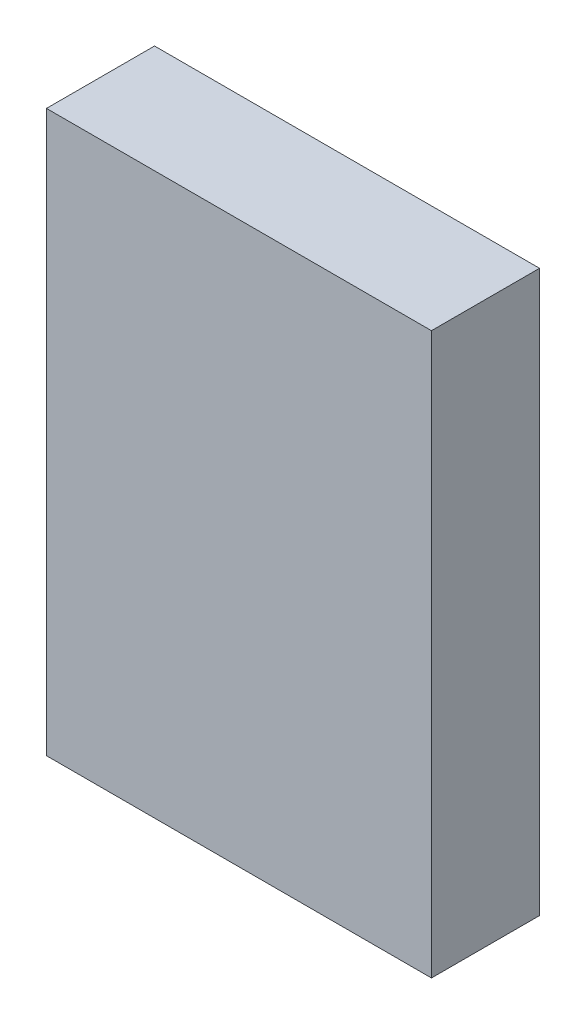
ISO-10303-21;
HEADER;
FILE_DESCRIPTION(('STEP AP214'),'2;1');
FILE_NAME('part.step','',(''),(''),'','','');
FILE_SCHEMA(('AUTOMOTIVE_DESIGN { 1 0 10303 214 1 1 1 1 }'));
ENDSEC;
DATA;
#1=APPLICATION_CONTEXT('core data for automotive mechanical design processes');
#2=APPLICATION_PROTOCOL_DEFINITION('international standard','automotive_design',2000,#1);
#3=PRODUCT_CONTEXT('',#1,'mechanical');
#4=PRODUCT('Part','Part','',(#3));
#5=PRODUCT_RELATED_PRODUCT_CATEGORY('part','',(#4));
#6=PRODUCT_DEFINITION_FORMATION('','',#4);
#7=PRODUCT_DEFINITION_CONTEXT('part definition',#1,'design');
#8=PRODUCT_DEFINITION('design','',#6,#7);
#9=PRODUCT_DEFINITION_SHAPE('','',#8);
#10=(LENGTH_UNIT() NAMED_UNIT(*) SI_UNIT(.MILLI.,.METRE.));
#11=(NAMED_UNIT(*) PLANE_ANGLE_UNIT() SI_UNIT($,.RADIAN.));
#12=(NAMED_UNIT(*) SI_UNIT($,.STERADIAN.) SOLID_ANGLE_UNIT());
#13=UNCERTAINTY_MEASURE_WITH_UNIT(LENGTH_MEASURE(1.E-05),#10,'distance_accuracy_value','');
#14=(GEOMETRIC_REPRESENTATION_CONTEXT(3) GLOBAL_UNCERTAINTY_ASSIGNED_CONTEXT((#13)) GLOBAL_UNIT_ASSIGNED_CONTEXT((#10,
#11,#12)) REPRESENTATION_CONTEXT('',''));
#15=CARTESIAN_POINT('',(0.,0.,0.));
#16=DIRECTION('',(0.,0.,1.));
#17=DIRECTION('',(1.,0.,0.));
#18=AXIS2_PLACEMENT_3D('',#15,#16,#17);
#19=CARTESIAN_POINT('',(0.,0.,16.));
#20=DIRECTION('',(0.,1.,0.));
#21=DIRECTION('',(0.,0.,1.));
#22=AXIS2_PLACEMENT_3D('',#19,#20,#21);
#23=PLANE('',#22);
#24=DIRECTION('',(1.,0.,0.));
#25=VECTOR('',#24,1.);
#26=CARTESIAN_POINT('',(0.,0.,0.));
#27=LINE('',#26,#25);
#28=CARTESIAN_POINT('',(-57.,0.,0.));
#29=VERTEX_POINT('',#28);
#30=CARTESIAN_POINT('',(0.,0.,0.));
#31=VERTEX_POINT('',#30);
#32=EDGE_CURVE('E106',#29,#31,#27,.T.);
#33=ORIENTED_EDGE('',*,*,#32,.T.);
#34=DIRECTION('',(0.,0.,-1.));
#35=VECTOR('',#34,1.);
#36=CARTESIAN_POINT('',(0.,0.,16.));
#37=LINE('',#36,#35);
#38=CARTESIAN_POINT('',(0.,0.,16.));
#39=VERTEX_POINT('',#38);
#40=EDGE_CURVE('E11',#39,#31,#37,.T.);
#41=ORIENTED_EDGE('',*,*,#40,.F.);
#42=DIRECTION('',(1.,0.,0.));
#43=VECTOR('',#42,1.);
#44=CARTESIAN_POINT('',(0.,0.,16.));
#45=LINE('',#44,#43);
#46=CARTESIAN_POINT('',(-57.,0.,16.));
#47=VERTEX_POINT('',#46);
#48=EDGE_CURVE('E94',#47,#39,#45,.T.);
#49=ORIENTED_EDGE('',*,*,#48,.F.);
#50=DIRECTION('',(0.,0.,-1.));
#51=VECTOR('',#50,1.);
#52=CARTESIAN_POINT('',(-57.,0.,16.));
#53=LINE('',#52,#51);
#54=EDGE_CURVE('E102',#47,#29,#53,.T.);
#55=ORIENTED_EDGE('',*,*,#54,.T.);
#56=EDGE_LOOP('',(#33,#41,#49,#55));
#57=FACE_BOUND('',#56,.T.);
#58=ADVANCED_FACE('F43',(#57),#23,.F.);
#59=CARTESIAN_POINT('',(0.,0.,16.));
#60=DIRECTION('',(-1.,0.,0.));
#61=DIRECTION('',(0.,0.,1.));
#62=AXIS2_PLACEMENT_3D('',#59,#60,#61);
#63=PLANE('',#62);
#64=DIRECTION('',(0.,1.,0.));
#65=VECTOR('',#64,1.);
#66=CARTESIAN_POINT('',(0.,0.,0.));
#67=LINE('',#66,#65);
#68=CARTESIAN_POINT('',(0.,83.,0.));
#69=VERTEX_POINT('',#68);
#70=EDGE_CURVE('E98',#31,#69,#67,.T.);
#71=ORIENTED_EDGE('',*,*,#70,.T.);
#72=DIRECTION('',(0.,0.,-1.));
#73=VECTOR('',#72,1.);
#74=CARTESIAN_POINT('',(0.,83.,16.));
#75=LINE('',#74,#73);
#76=CARTESIAN_POINT('',(0.,83.,16.));
#77=VERTEX_POINT('',#76);
#78=EDGE_CURVE('E51',#77,#69,#75,.T.);
#79=ORIENTED_EDGE('',*,*,#78,.F.);
#80=DIRECTION('',(0.,1.,0.));
#81=VECTOR('',#80,1.);
#82=CARTESIAN_POINT('',(0.,0.,16.));
#83=LINE('',#82,#81);
#84=EDGE_CURVE('E89',#39,#77,#83,.T.);
#85=ORIENTED_EDGE('',*,*,#84,.F.);
#86=ORIENTED_EDGE('',*,*,#40,.T.);
#87=EDGE_LOOP('',(#71,#79,#85,#86));
#88=FACE_BOUND('',#87,.T.);
#89=ADVANCED_FACE('F97',(#88),#63,.F.);
#90=CARTESIAN_POINT('',(0.,83.,16.));
#91=DIRECTION('',(0.,-1.,0.));
#92=DIRECTION('',(0.,0.,-1.));
#93=AXIS2_PLACEMENT_3D('',#90,#91,#92);
#94=PLANE('',#93);
#95=DIRECTION('',(-1.,0.,0.));
#96=VECTOR('',#95,1.);
#97=CARTESIAN_POINT('',(0.,83.,0.));
#98=LINE('',#97,#96);
#99=CARTESIAN_POINT('',(-57.,83.,0.));
#100=VERTEX_POINT('',#99);
#101=EDGE_CURVE('E76',#69,#100,#98,.T.);
#102=ORIENTED_EDGE('',*,*,#101,.T.);
#103=DIRECTION('',(0.,0.,-1.));
#104=VECTOR('',#103,1.);
#105=CARTESIAN_POINT('',(-57.,83.,16.));
#106=LINE('',#105,#104);
#107=CARTESIAN_POINT('',(-57.,83.,16.));
#108=VERTEX_POINT('',#107);
#109=EDGE_CURVE('E99',#108,#100,#106,.T.);
#110=ORIENTED_EDGE('',*,*,#109,.F.);
#111=DIRECTION('',(-1.,0.,0.));
#112=VECTOR('',#111,1.);
#113=CARTESIAN_POINT('',(0.,83.,16.));
#114=LINE('',#113,#112);
#115=EDGE_CURVE('E92',#77,#108,#114,.T.);
#116=ORIENTED_EDGE('',*,*,#115,.F.);
#117=ORIENTED_EDGE('',*,*,#78,.T.);
#118=EDGE_LOOP('',(#102,#110,#116,#117));
#119=FACE_BOUND('',#118,.T.);
#120=ADVANCED_FACE('F100',(#119),#94,.F.);
#121=CARTESIAN_POINT('',(-57.,0.,16.));
#122=DIRECTION('',(1.,0.,0.));
#123=DIRECTION('',(0.,0.,-1.));
#124=AXIS2_PLACEMENT_3D('',#121,#122,#123);
#125=PLANE('',#124);
#126=DIRECTION('',(0.,-1.,0.));
#127=VECTOR('',#126,1.);
#128=CARTESIAN_POINT('',(-57.,0.,0.));
#129=LINE('',#128,#127);
#130=EDGE_CURVE('E82',#100,#29,#129,.T.);
#131=ORIENTED_EDGE('',*,*,#130,.T.);
#132=ORIENTED_EDGE('',*,*,#54,.F.);
#133=DIRECTION('',(0.,-1.,0.));
#134=VECTOR('',#133,1.);
#135=CARTESIAN_POINT('',(-57.,0.,16.));
#136=LINE('',#135,#134);
#137=EDGE_CURVE('E59',#108,#47,#136,.T.);
#138=ORIENTED_EDGE('',*,*,#137,.F.);
#139=ORIENTED_EDGE('',*,*,#109,.T.);
#140=EDGE_LOOP('',(#131,#132,#138,#139));
#141=FACE_BOUND('',#140,.T.);
#142=ADVANCED_FACE('F113',(#141),#125,.F.);
#143=CARTESIAN_POINT('',(0.,0.,16.));
#144=DIRECTION('',(0.,0.,-1.));
#145=DIRECTION('',(-1.,0.,0.));
#146=AXIS2_PLACEMENT_3D('',#143,#144,#145);
#147=PLANE('',#146);
#148=ORIENTED_EDGE('',*,*,#48,.T.);
#149=ORIENTED_EDGE('',*,*,#84,.T.);
#150=ORIENTED_EDGE('',*,*,#115,.T.);
#151=ORIENTED_EDGE('',*,*,#137,.T.);
#152=EDGE_LOOP('',(#148,#149,#150,#151));
#153=FACE_BOUND('',#152,.T.);
#154=ADVANCED_FACE('F90',(#153),#147,.F.);
#155=CARTESIAN_POINT('',(0.,0.,0.));
#156=DIRECTION('',(0.,0.,-1.));
#157=DIRECTION('',(-1.,0.,0.));
#158=AXIS2_PLACEMENT_3D('',#155,#156,#157);
#159=PLANE('',#158);
#160=ORIENTED_EDGE('',*,*,#32,.F.);
#161=ORIENTED_EDGE('',*,*,#130,.F.);
#162=ORIENTED_EDGE('',*,*,#101,.F.);
#163=ORIENTED_EDGE('',*,*,#70,.F.);
#164=EDGE_LOOP('',(#160,#161,#162,#163));
#165=FACE_BOUND('',#164,.T.);
#166=ADVANCED_FACE('F116',(#165),#159,.T.);
#167=CLOSED_SHELL('',(#58,#89,#120,#142,#154,#166));
#168=MANIFOLD_SOLID_BREP('B2',#167);
#169=ADVANCED_BREP_SHAPE_REPRESENTATION('',(#18,#168),#14);
#170=SHAPE_DEFINITION_REPRESENTATION(#9,#169);
ENDSEC;
END-ISO-10303-21;
